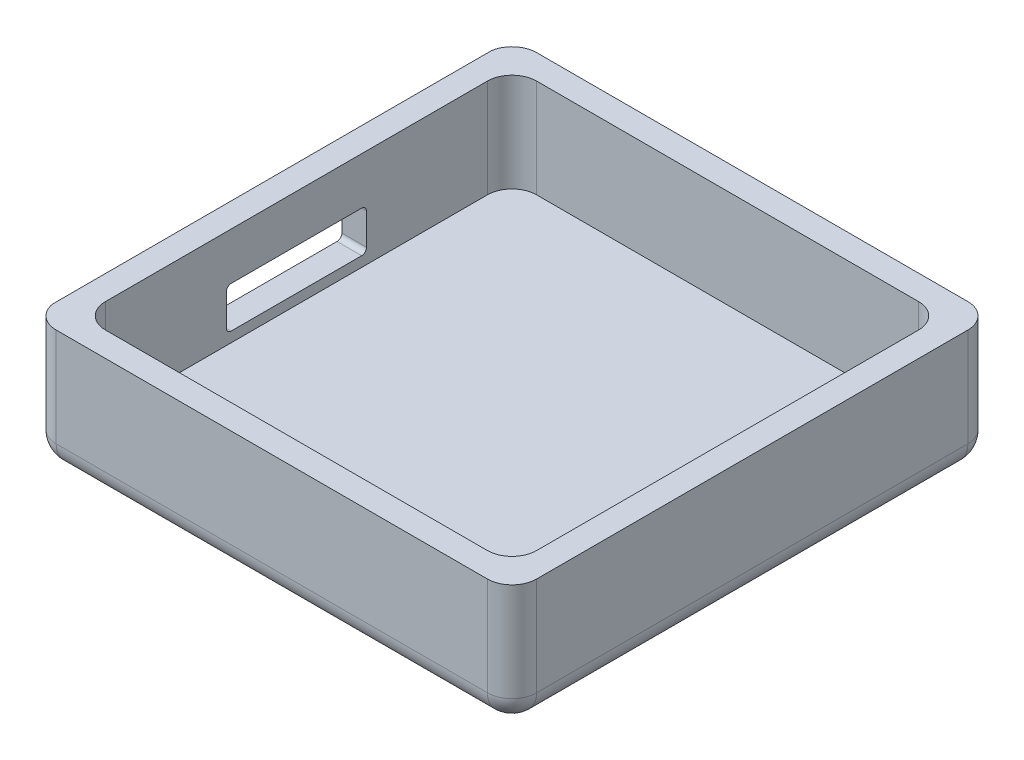
ISO-10303-21;
HEADER;
FILE_DESCRIPTION(('STEP AP214'),'2;1');
FILE_NAME('part.step','',(''),(''),'','','');
FILE_SCHEMA(('AUTOMOTIVE_DESIGN { 1 0 10303 214 1 1 1 1 }'));
ENDSEC;
DATA;
#1=APPLICATION_CONTEXT('core data for automotive mechanical design processes');
#2=APPLICATION_PROTOCOL_DEFINITION('international standard','automotive_design',2000,#1);
#3=PRODUCT_CONTEXT('',#1,'mechanical');
#4=PRODUCT('Part','Part','',(#3));
#5=PRODUCT_RELATED_PRODUCT_CATEGORY('part','',(#4));
#6=PRODUCT_DEFINITION_FORMATION('','',#4);
#7=PRODUCT_DEFINITION_CONTEXT('part definition',#1,'design');
#8=PRODUCT_DEFINITION('design','',#6,#7);
#9=PRODUCT_DEFINITION_SHAPE('','',#8);
#10=(LENGTH_UNIT() NAMED_UNIT(*) SI_UNIT(.MILLI.,.METRE.));
#11=(NAMED_UNIT(*) PLANE_ANGLE_UNIT() SI_UNIT($,.RADIAN.));
#12=(NAMED_UNIT(*) SI_UNIT($,.STERADIAN.) SOLID_ANGLE_UNIT());
#13=UNCERTAINTY_MEASURE_WITH_UNIT(LENGTH_MEASURE(1.E-05),#10,'distance_accuracy_value','');
#14=(GEOMETRIC_REPRESENTATION_CONTEXT(3) GLOBAL_UNCERTAINTY_ASSIGNED_CONTEXT((#13)) GLOBAL_UNIT_ASSIGNED_CONTEXT((#10,
#11,#12)) REPRESENTATION_CONTEXT('',''));
#15=CARTESIAN_POINT('',(0.,0.,0.));
#16=DIRECTION('',(0.,0.,1.));
#17=DIRECTION('',(1.,0.,0.));
#18=AXIS2_PLACEMENT_3D('',#15,#16,#17);
#19=CARTESIAN_POINT('',(-5.08,-12.7,0.));
#20=DIRECTION('',(1.,0.,0.));
#21=DIRECTION('',(0.,0.,-1.));
#22=AXIS2_PLACEMENT_3D('',#19,#20,#21);
#23=PLANE('',#22);
#24=DIRECTION('',(0.,0.,-1.));
#25=VECTOR('',#24,1.);
#26=CARTESIAN_POINT('',(-5.08,-12.7,0.));
#27=LINE('',#26,#25);
#28=CARTESIAN_POINT('',(-5.08,-12.7,-88.9));
#29=VERTEX_POINT('',#28);
#30=CARTESIAN_POINT('',(-5.08,-12.7,0.));
#31=VERTEX_POINT('',#30);
#32=EDGE_CURVE('E286',#29,#31,#27,.F.);
#33=ORIENTED_EDGE('',*,*,#32,.T.);
#34=DIRECTION('',(0.,1.,0.));
#35=VECTOR('',#34,1.);
#36=CARTESIAN_POINT('',(-5.08,-12.7,0.));
#37=LINE('',#36,#35);
#38=CARTESIAN_POINT('',(-5.08,0.,0.));
#39=VERTEX_POINT('',#38);
#40=EDGE_CURVE('E288',#31,#39,#37,.T.);
#41=ORIENTED_EDGE('',*,*,#40,.T.);
#42=DIRECTION('',(0.,0.,-1.));
#43=VECTOR('',#42,1.);
#44=CARTESIAN_POINT('',(-5.08,0.,0.));
#45=LINE('',#44,#43);
#46=CARTESIAN_POINT('',(-5.08,0.,-88.9));
#47=VERTEX_POINT('',#46);
#48=EDGE_CURVE('E265',#39,#47,#45,.T.);
#49=ORIENTED_EDGE('',*,*,#48,.T.);
#50=DIRECTION('',(0.,1.,0.));
#51=VECTOR('',#50,1.);
#52=CARTESIAN_POINT('',(-5.08,-12.7,-88.9));
#53=LINE('',#52,#51);
#54=EDGE_CURVE('E284',#47,#29,#53,.F.);
#55=ORIENTED_EDGE('',*,*,#54,.T.);
#56=EDGE_LOOP('',(#33,#41,#49,#55));
#57=FACE_BOUND('',#56,.T.);
#58=DIRECTION('',(0.,0.,1.));
#59=VECTOR('',#58,1.);
#60=CARTESIAN_POINT('',(-5.08,-2.1,0.));
#61=LINE('',#60,#59);
#62=CARTESIAN_POINT('',(-5.08,-2.1,-57.9));
#63=VERTEX_POINT('',#62);
#64=CARTESIAN_POINT('',(-5.08,-2.1,-31.));
#65=VERTEX_POINT('',#64);
#66=EDGE_CURVE('E425',#63,#65,#61,.T.);
#67=ORIENTED_EDGE('',*,*,#66,.T.);
#68=CARTESIAN_POINT('',(-5.08,-3.1,-31.));
#69=DIRECTION('',(1.,0.,0.));
#70=DIRECTION('',(0.,0.,-1.));
#71=AXIS2_PLACEMENT_3D('',#68,#69,#70);
#72=CIRCLE('',#71,1.);
#73=CARTESIAN_POINT('',(-5.08,-3.1,-30.));
#74=VERTEX_POINT('',#73);
#75=EDGE_CURVE('E400',#65,#74,#72,.T.);
#76=ORIENTED_EDGE('',*,*,#75,.T.);
#77=DIRECTION('',(0.,-1.,0.));
#78=VECTOR('',#77,1.);
#79=CARTESIAN_POINT('',(-5.08,0.,-30.));
#80=LINE('',#79,#78);
#81=CARTESIAN_POINT('',(-5.08,-9.6,-30.));
#82=VERTEX_POINT('',#81);
#83=EDGE_CURVE('E431',#74,#82,#80,.T.);
#84=ORIENTED_EDGE('',*,*,#83,.T.);
#85=CARTESIAN_POINT('',(-5.08,-9.6,-31.));
#86=DIRECTION('',(1.,0.,0.));
#87=DIRECTION('',(0.,0.,-1.));
#88=AXIS2_PLACEMENT_3D('',#85,#86,#87);
#89=CIRCLE('',#88,1.);
#90=CARTESIAN_POINT('',(-5.08,-10.6,-31.));
#91=VERTEX_POINT('',#90);
#92=EDGE_CURVE('E408',#82,#91,#89,.T.);
#93=ORIENTED_EDGE('',*,*,#92,.T.);
#94=DIRECTION('',(0.,0.,1.));
#95=VECTOR('',#94,1.);
#96=CARTESIAN_POINT('',(-5.08,-10.6,0.));
#97=LINE('',#96,#95);
#98=CARTESIAN_POINT('',(-5.08,-10.6,-57.9));
#99=VERTEX_POINT('',#98);
#100=EDGE_CURVE('E417',#99,#91,#97,.T.);
#101=ORIENTED_EDGE('',*,*,#100,.F.);
#102=CARTESIAN_POINT('',(-5.08,-9.6,-57.9));
#103=DIRECTION('',(1.,0.,0.));
#104=DIRECTION('',(0.,0.,-1.));
#105=AXIS2_PLACEMENT_3D('',#102,#103,#104);
#106=CIRCLE('',#105,1.);
#107=CARTESIAN_POINT('',(-5.08,-9.6,-58.9));
#108=VERTEX_POINT('',#107);
#109=EDGE_CURVE('E50',#99,#108,#106,.T.);
#110=ORIENTED_EDGE('',*,*,#109,.T.);
#111=DIRECTION('',(0.,-1.,0.));
#112=VECTOR('',#111,1.);
#113=CARTESIAN_POINT('',(-5.08,0.,-58.9));
#114=LINE('',#113,#112);
#115=CARTESIAN_POINT('',(-5.08,-3.1,-58.9));
#116=VERTEX_POINT('',#115);
#117=EDGE_CURVE('E416',#116,#108,#114,.T.);
#118=ORIENTED_EDGE('',*,*,#117,.F.);
#119=CARTESIAN_POINT('',(-5.08,-3.1,-57.9));
#120=DIRECTION('',(1.,0.,0.));
#121=DIRECTION('',(0.,0.,-1.));
#122=AXIS2_PLACEMENT_3D('',#119,#120,#121);
#123=CIRCLE('',#122,1.);
#124=EDGE_CURVE('E404',#116,#63,#123,.T.);
#125=ORIENTED_EDGE('',*,*,#124,.T.);
#126=EDGE_LOOP('',(#67,#76,#84,#93,#101,#110,#118,#125));
#127=FACE_BOUND('',#126,.T.);
#128=ADVANCED_FACE('F42',(#57,#127),#23,.F.);
#129=CARTESIAN_POINT('',(0.,-12.7,0.));
#130=DIRECTION('',(1.,0.,0.));
#131=DIRECTION('',(0.,0.,-1.));
#132=AXIS2_PLACEMENT_3D('',#129,#130,#131);
#133=PLANE('',#132);
#134=DIRECTION('',(0.,0.,-1.));
#135=VECTOR('',#134,1.);
#136=CARTESIAN_POINT('',(0.,-12.7,0.));
#137=LINE('',#136,#135);
#138=CARTESIAN_POINT('',(0.,-12.7,-5.08));
#139=VERTEX_POINT('',#138);
#140=CARTESIAN_POINT('',(0.,-12.7,-83.82));
#141=VERTEX_POINT('',#140);
#142=EDGE_CURVE('E264',#139,#141,#137,.T.);
#143=ORIENTED_EDGE('',*,*,#142,.T.);
#144=DIRECTION('',(0.,1.,0.));
#145=VECTOR('',#144,1.);
#146=CARTESIAN_POINT('',(0.,7.62,-83.82));
#147=LINE('',#146,#145);
#148=CARTESIAN_POINT('',(0.,7.62,-83.82));
#149=VERTEX_POINT('',#148);
#150=EDGE_CURVE('E363',#141,#149,#147,.T.);
#151=ORIENTED_EDGE('',*,*,#150,.T.);
#152=DIRECTION('',(0.,0.,-1.));
#153=VECTOR('',#152,1.);
#154=CARTESIAN_POINT('',(0.,7.62,0.));
#155=LINE('',#154,#153);
#156=CARTESIAN_POINT('',(0.,7.62,-5.08));
#157=VERTEX_POINT('',#156);
#158=EDGE_CURVE('E450',#157,#149,#155,.T.);
#159=ORIENTED_EDGE('',*,*,#158,.F.);
#160=DIRECTION('',(0.,1.,0.));
#161=VECTOR('',#160,1.);
#162=CARTESIAN_POINT('',(0.,-12.7,-5.08));
#163=LINE('',#162,#161);
#164=EDGE_CURVE('E366',#157,#139,#163,.F.);
#165=ORIENTED_EDGE('',*,*,#164,.T.);
#166=EDGE_LOOP('',(#143,#151,#159,#165));
#167=FACE_BOUND('',#166,.T.);
#168=DIRECTION('',(0.,-1.,0.));
#169=VECTOR('',#168,1.);
#170=CARTESIAN_POINT('',(0.,0.,-58.9));
#171=LINE('',#170,#169);
#172=CARTESIAN_POINT('',(0.,-3.1,-58.9));
#173=VERTEX_POINT('',#172);
#174=CARTESIAN_POINT('',(0.,-9.6,-58.9));
#175=VERTEX_POINT('',#174);
#176=EDGE_CURVE('E430',#173,#175,#171,.T.);
#177=ORIENTED_EDGE('',*,*,#176,.T.);
#178=CARTESIAN_POINT('',(0.,-9.6,-57.9));
#179=DIRECTION('',(1.,0.,0.));
#180=DIRECTION('',(0.,0.,-1.));
#181=AXIS2_PLACEMENT_3D('',#178,#179,#180);
#182=CIRCLE('',#181,1.);
#183=CARTESIAN_POINT('',(0.,-10.6,-57.9));
#184=VERTEX_POINT('',#183);
#185=EDGE_CURVE('E11',#175,#184,#182,.F.);
#186=ORIENTED_EDGE('',*,*,#185,.T.);
#187=DIRECTION('',(0.,0.,1.));
#188=VECTOR('',#187,1.);
#189=CARTESIAN_POINT('',(0.,-10.6,0.));
#190=LINE('',#189,#188);
#191=CARTESIAN_POINT('',(0.,-10.6,-31.));
#192=VERTEX_POINT('',#191);
#193=EDGE_CURVE('E428',#184,#192,#190,.T.);
#194=ORIENTED_EDGE('',*,*,#193,.T.);
#195=CARTESIAN_POINT('',(0.,-9.6,-31.));
#196=DIRECTION('',(1.,0.,0.));
#197=DIRECTION('',(0.,0.,-1.));
#198=AXIS2_PLACEMENT_3D('',#195,#196,#197);
#199=CIRCLE('',#198,1.);
#200=CARTESIAN_POINT('',(0.,-9.6,-30.));
#201=VERTEX_POINT('',#200);
#202=EDGE_CURVE('E410',#192,#201,#199,.F.);
#203=ORIENTED_EDGE('',*,*,#202,.T.);
#204=DIRECTION('',(0.,-1.,0.));
#205=VECTOR('',#204,1.);
#206=CARTESIAN_POINT('',(0.,0.,-30.));
#207=LINE('',#206,#205);
#208=CARTESIAN_POINT('',(0.,-3.1,-30.));
#209=VERTEX_POINT('',#208);
#210=EDGE_CURVE('E437',#209,#201,#207,.T.);
#211=ORIENTED_EDGE('',*,*,#210,.F.);
#212=CARTESIAN_POINT('',(0.,-3.1,-31.));
#213=DIRECTION('',(1.,0.,0.));
#214=DIRECTION('',(0.,0.,-1.));
#215=AXIS2_PLACEMENT_3D('',#212,#213,#214);
#216=CIRCLE('',#215,1.);
#217=CARTESIAN_POINT('',(0.,-2.1,-31.));
#218=VERTEX_POINT('',#217);
#219=EDGE_CURVE('E402',#209,#218,#216,.F.);
#220=ORIENTED_EDGE('',*,*,#219,.T.);
#221=DIRECTION('',(0.,0.,1.));
#222=VECTOR('',#221,1.);
#223=CARTESIAN_POINT('',(0.,-2.1,0.));
#224=LINE('',#223,#222);
#225=CARTESIAN_POINT('',(0.,-2.1,-57.9));
#226=VERTEX_POINT('',#225);
#227=EDGE_CURVE('E441',#226,#218,#224,.T.);
#228=ORIENTED_EDGE('',*,*,#227,.F.);
#229=CARTESIAN_POINT('',(0.,-3.1,-57.9));
#230=DIRECTION('',(1.,0.,0.));
#231=DIRECTION('',(0.,0.,-1.));
#232=AXIS2_PLACEMENT_3D('',#229,#230,#231);
#233=CIRCLE('',#232,1.);
#234=EDGE_CURVE('E406',#226,#173,#233,.F.);
#235=ORIENTED_EDGE('',*,*,#234,.T.);
#236=EDGE_LOOP('',(#177,#186,#194,#203,#211,#220,#228,#235));
#237=FACE_BOUND('',#236,.T.);
#238=ADVANCED_FACE('F536',(#167,#237),#133,.T.);
#239=CARTESIAN_POINT('',(0.,-12.7,0.));
#240=DIRECTION('',(0.,0.,1.));
#241=DIRECTION('',(1.,0.,0.));
#242=AXIS2_PLACEMENT_3D('',#239,#240,#241);
#243=PLANE('',#242);
#244=DIRECTION('',(0.,1.,0.));
#245=VECTOR('',#244,1.);
#246=CARTESIAN_POINT('',(83.82,-12.7,0.));
#247=LINE('',#246,#245);
#248=CARTESIAN_POINT('',(83.82,7.62,0.));
#249=VERTEX_POINT('',#248);
#250=CARTESIAN_POINT('',(83.82,-12.7,0.));
#251=VERTEX_POINT('',#250);
#252=EDGE_CURVE('E351',#249,#251,#247,.F.);
#253=ORIENTED_EDGE('',*,*,#252,.T.);
#254=DIRECTION('',(1.,0.,0.));
#255=VECTOR('',#254,1.);
#256=CARTESIAN_POINT('',(0.,-12.7,0.));
#257=LINE('',#256,#255);
#258=CARTESIAN_POINT('',(5.08,-12.7,0.));
#259=VERTEX_POINT('',#258);
#260=EDGE_CURVE('E262',#259,#251,#257,.T.);
#261=ORIENTED_EDGE('',*,*,#260,.F.);
#262=DIRECTION('',(0.,1.,0.));
#263=VECTOR('',#262,1.);
#264=CARTESIAN_POINT('',(5.08,-12.7,0.));
#265=LINE('',#264,#263);
#266=CARTESIAN_POINT('',(5.08,7.62,0.));
#267=VERTEX_POINT('',#266);
#268=EDGE_CURVE('E348',#259,#267,#265,.T.);
#269=ORIENTED_EDGE('',*,*,#268,.T.);
#270=DIRECTION('',(-1.,0.,0.));
#271=VECTOR('',#270,1.);
#272=CARTESIAN_POINT('',(0.,7.62,0.));
#273=LINE('',#272,#271);
#274=EDGE_CURVE('E447',#249,#267,#273,.T.);
#275=ORIENTED_EDGE('',*,*,#274,.F.);
#276=EDGE_LOOP('',(#253,#261,#269,#275));
#277=FACE_BOUND('',#276,.T.);
#278=ADVANCED_FACE('F541',(#277),#243,.F.);
#279=CARTESIAN_POINT('',(88.9,-12.7,0.));
#280=DIRECTION('',(1.,0.,0.));
#281=DIRECTION('',(0.,0.,-1.));
#282=AXIS2_PLACEMENT_3D('',#279,#280,#281);
#283=PLANE('',#282);
#284=DIRECTION('',(0.,0.,-1.));
#285=VECTOR('',#284,1.);
#286=CARTESIAN_POINT('',(88.9,-12.7,0.));
#287=LINE('',#286,#285);
#288=CARTESIAN_POINT('',(88.9,-12.7,-5.08));
#289=VERTEX_POINT('',#288);
#290=CARTESIAN_POINT('',(88.9,-12.7,-83.82));
#291=VERTEX_POINT('',#290);
#292=EDGE_CURVE('E270',#289,#291,#287,.T.);
#293=ORIENTED_EDGE('',*,*,#292,.F.);
#294=DIRECTION('',(0.,1.,0.));
#295=VECTOR('',#294,1.);
#296=CARTESIAN_POINT('',(88.9,7.62,-5.08));
#297=LINE('',#296,#295);
#298=CARTESIAN_POINT('',(88.9,7.62,-5.08));
#299=VERTEX_POINT('',#298);
#300=EDGE_CURVE('E345',#289,#299,#297,.T.);
#301=ORIENTED_EDGE('',*,*,#300,.T.);
#302=DIRECTION('',(0.,0.,1.));
#303=VECTOR('',#302,1.);
#304=CARTESIAN_POINT('',(88.9,7.62,0.));
#305=LINE('',#304,#303);
#306=CARTESIAN_POINT('',(88.9,7.62,-83.82));
#307=VERTEX_POINT('',#306);
#308=EDGE_CURVE('E444',#307,#299,#305,.T.);
#309=ORIENTED_EDGE('',*,*,#308,.F.);
#310=DIRECTION('',(0.,1.,0.));
#311=VECTOR('',#310,1.);
#312=CARTESIAN_POINT('',(88.9,-12.7,-83.82));
#313=LINE('',#312,#311);
#314=EDGE_CURVE('E311',#307,#291,#313,.F.);
#315=ORIENTED_EDGE('',*,*,#314,.T.);
#316=EDGE_LOOP('',(#293,#301,#309,#315));
#317=FACE_BOUND('',#316,.T.);
#318=ADVANCED_FACE('F574',(#317),#283,.F.);
#319=CARTESIAN_POINT('',(0.,-12.7,-88.9));
#320=DIRECTION('',(0.,0.,1.));
#321=DIRECTION('',(1.,0.,0.));
#322=AXIS2_PLACEMENT_3D('',#319,#320,#321);
#323=PLANE('',#322);
#324=DIRECTION('',(1.,0.,0.));
#325=VECTOR('',#324,1.);
#326=CARTESIAN_POINT('',(0.,-12.7,-88.9));
#327=LINE('',#326,#325);
#328=CARTESIAN_POINT('',(5.08,-12.7,-88.9));
#329=VERTEX_POINT('',#328);
#330=CARTESIAN_POINT('',(83.82,-12.7,-88.9));
#331=VERTEX_POINT('',#330);
#332=EDGE_CURVE('E267',#329,#331,#327,.T.);
#333=ORIENTED_EDGE('',*,*,#332,.T.);
#334=DIRECTION('',(0.,1.,0.));
#335=VECTOR('',#334,1.);
#336=CARTESIAN_POINT('',(83.82,-12.7,-88.9));
#337=LINE('',#336,#335);
#338=CARTESIAN_POINT('',(83.82,7.62,-88.9));
#339=VERTEX_POINT('',#338);
#340=EDGE_CURVE('E370',#331,#339,#337,.T.);
#341=ORIENTED_EDGE('',*,*,#340,.T.);
#342=DIRECTION('',(1.,0.,0.));
#343=VECTOR('',#342,1.);
#344=CARTESIAN_POINT('',(0.,7.62,-88.9));
#345=LINE('',#344,#343);
#346=CARTESIAN_POINT('',(5.08,7.62,-88.9));
#347=VERTEX_POINT('',#346);
#348=EDGE_CURVE('E248',#347,#339,#345,.T.);
#349=ORIENTED_EDGE('',*,*,#348,.F.);
#350=DIRECTION('',(0.,1.,0.));
#351=VECTOR('',#350,1.);
#352=CARTESIAN_POINT('',(5.08,-12.7,-88.9));
#353=LINE('',#352,#351);
#354=EDGE_CURVE('E368',#347,#329,#353,.F.);
#355=ORIENTED_EDGE('',*,*,#354,.T.);
#356=EDGE_LOOP('',(#333,#341,#349,#355));
#357=FACE_BOUND('',#356,.T.);
#358=ADVANCED_FACE('F552',(#357),#323,.T.);
#359=CARTESIAN_POINT('',(0.,-12.7,5.08));
#360=DIRECTION('',(0.,0.,-1.));
#361=DIRECTION('',(-1.,0.,0.));
#362=AXIS2_PLACEMENT_3D('',#359,#360,#361);
#363=PLANE('',#362);
#364=DIRECTION('',(-1.,0.,0.));
#365=VECTOR('',#364,1.);
#366=CARTESIAN_POINT('',(0.,-12.7,5.08));
#367=LINE('',#366,#365);
#368=CARTESIAN_POINT('',(0.,-12.7,5.08));
#369=VERTEX_POINT('',#368);
#370=CARTESIAN_POINT('',(88.9,-12.7,5.07999999999997));
#371=VERTEX_POINT('',#370);
#372=EDGE_CURVE('E296',#369,#371,#367,.F.);
#373=ORIENTED_EDGE('',*,*,#372,.T.);
#374=DIRECTION('',(0.,1.,0.));
#375=VECTOR('',#374,1.);
#376=CARTESIAN_POINT('',(88.9,0.,5.07999999999997));
#377=LINE('',#376,#375);
#378=CARTESIAN_POINT('',(88.9,7.62,5.07999999999997));
#379=VERTEX_POINT('',#378);
#380=EDGE_CURVE('E294',#371,#379,#377,.T.);
#381=ORIENTED_EDGE('',*,*,#380,.T.);
#382=DIRECTION('',(1.,0.,0.));
#383=VECTOR('',#382,1.);
#384=CARTESIAN_POINT('',(0.,7.62,5.08));
#385=LINE('',#384,#383);
#386=CARTESIAN_POINT('',(0.,7.62,5.08));
#387=VERTEX_POINT('',#386);
#388=EDGE_CURVE('E456',#387,#379,#385,.T.);
#389=ORIENTED_EDGE('',*,*,#388,.F.);
#390=DIRECTION('',(0.,1.,0.));
#391=VECTOR('',#390,1.);
#392=CARTESIAN_POINT('',(0.,-12.7,5.08));
#393=LINE('',#392,#391);
#394=EDGE_CURVE('E298',#387,#369,#393,.F.);
#395=ORIENTED_EDGE('',*,*,#394,.T.);
#396=EDGE_LOOP('',(#373,#381,#389,#395));
#397=FACE_BOUND('',#396,.T.);
#398=ADVANCED_FACE('F478',(#397),#363,.F.);
#399=CARTESIAN_POINT('',(0.,-12.7,-93.98));
#400=DIRECTION('',(0.,0.,1.));
#401=DIRECTION('',(1.,0.,0.));
#402=AXIS2_PLACEMENT_3D('',#399,#400,#401);
#403=PLANE('',#402);
#404=DIRECTION('',(0.,1.,0.));
#405=VECTOR('',#404,1.);
#406=CARTESIAN_POINT('',(0.,-12.7,-93.98));
#407=LINE('',#406,#405);
#408=CARTESIAN_POINT('',(0.,-12.7,-93.98));
#409=VERTEX_POINT('',#408);
#410=CARTESIAN_POINT('',(0.,7.62,-93.98));
#411=VERTEX_POINT('',#410);
#412=EDGE_CURVE('E306',#409,#411,#407,.T.);
#413=ORIENTED_EDGE('',*,*,#412,.T.);
#414=DIRECTION('',(-1.,0.,0.));
#415=VECTOR('',#414,1.);
#416=CARTESIAN_POINT('',(0.,7.62,-93.98));
#417=LINE('',#416,#415);
#418=CARTESIAN_POINT('',(88.9,7.62,-93.98));
#419=VERTEX_POINT('',#418);
#420=EDGE_CURVE('E245',#419,#411,#417,.T.);
#421=ORIENTED_EDGE('',*,*,#420,.F.);
#422=DIRECTION('',(0.,1.,0.));
#423=VECTOR('',#422,1.);
#424=CARTESIAN_POINT('',(88.9,-17.78,-93.98));
#425=LINE('',#424,#423);
#426=CARTESIAN_POINT('',(88.9,-12.7,-93.98));
#427=VERTEX_POINT('',#426);
#428=EDGE_CURVE('E310',#419,#427,#425,.F.);
#429=ORIENTED_EDGE('',*,*,#428,.T.);
#430=DIRECTION('',(1.,0.,0.));
#431=VECTOR('',#430,1.);
#432=CARTESIAN_POINT('',(0.,-12.7,-93.98));
#433=LINE('',#432,#431);
#434=EDGE_CURVE('E308',#427,#409,#433,.F.);
#435=ORIENTED_EDGE('',*,*,#434,.T.);
#436=EDGE_LOOP('',(#413,#421,#429,#435));
#437=FACE_BOUND('',#436,.T.);
#438=ADVANCED_FACE('F512',(#437),#403,.F.);
#439=CARTESIAN_POINT('',(93.98,-12.7,0.));
#440=DIRECTION('',(1.,0.,0.));
#441=DIRECTION('',(0.,0.,-1.));
#442=AXIS2_PLACEMENT_3D('',#439,#440,#441);
#443=PLANE('',#442);
#444=DIRECTION('',(0.,1.,0.));
#445=VECTOR('',#444,1.);
#446=CARTESIAN_POINT('',(93.98,0.,-88.9));
#447=LINE('',#446,#445);
#448=CARTESIAN_POINT('',(93.98,-12.7,-88.9));
#449=VERTEX_POINT('',#448);
#450=CARTESIAN_POINT('',(93.98,7.62,-88.9));
#451=VERTEX_POINT('',#450);
#452=EDGE_CURVE('E300',#449,#451,#447,.T.);
#453=ORIENTED_EDGE('',*,*,#452,.T.);
#454=DIRECTION('',(0.,0.,-1.));
#455=VECTOR('',#454,1.);
#456=CARTESIAN_POINT('',(93.98,7.62,0.));
#457=LINE('',#456,#455);
#458=CARTESIAN_POINT('',(93.98,7.62,0.));
#459=VERTEX_POINT('',#458);
#460=EDGE_CURVE('E462',#459,#451,#457,.T.);
#461=ORIENTED_EDGE('',*,*,#460,.F.);
#462=DIRECTION('',(0.,1.,0.));
#463=VECTOR('',#462,1.);
#464=CARTESIAN_POINT('',(93.98,-17.78,0.));
#465=LINE('',#464,#463);
#466=CARTESIAN_POINT('',(93.98,-12.7,0.));
#467=VERTEX_POINT('',#466);
#468=EDGE_CURVE('E304',#459,#467,#465,.F.);
#469=ORIENTED_EDGE('',*,*,#468,.T.);
#470=DIRECTION('',(0.,0.,1.));
#471=VECTOR('',#470,1.);
#472=CARTESIAN_POINT('',(93.98,-12.7,-93.98));
#473=LINE('',#472,#471);
#474=EDGE_CURVE('E302',#467,#449,#473,.F.);
#475=ORIENTED_EDGE('',*,*,#474,.T.);
#476=EDGE_LOOP('',(#453,#461,#469,#475));
#477=FACE_BOUND('',#476,.T.);
#478=ADVANCED_FACE('F504',(#477),#443,.T.);
#479=CARTESIAN_POINT('',(0.,0.,0.));
#480=DIRECTION('',(0.,1.,0.));
#481=DIRECTION('',(0.,0.,1.));
#482=AXIS2_PLACEMENT_3D('',#479,#480,#481);
#483=PLANE('',#482);
#484=CARTESIAN_POINT('',(0.,0.,-88.9));
#485=DIRECTION('',(0.,1.,0.));
#486=DIRECTION('',(0.,0.,1.));
#487=AXIS2_PLACEMENT_3D('',#484,#485,#486);
#488=CIRCLE('',#487,5.08);
#489=CARTESIAN_POINT('',(-5.01518473673634,0.,-89.7089017594287));
#490=VERTEX_POINT('',#489);
#491=EDGE_CURVE('E254',#490,#47,#488,.T.);
#492=ORIENTED_EDGE('',*,*,#491,.T.);
#493=ORIENTED_EDGE('',*,*,#48,.F.);
#494=CARTESIAN_POINT('',(0.,0.,0.));
#495=DIRECTION('',(0.,1.,0.));
#496=DIRECTION('',(0.,0.,1.));
#497=AXIS2_PLACEMENT_3D('',#494,#495,#496);
#498=CIRCLE('',#497,5.08);
#499=CARTESIAN_POINT('',(-5.01518473673634,0.,0.808901759428709));
#500=VERTEX_POINT('',#499);
#501=EDGE_CURVE('E291',#39,#500,#498,.T.);
#502=ORIENTED_EDGE('',*,*,#501,.T.);
#503=DIRECTION('',(0.,0.,1.));
#504=VECTOR('',#503,1.);
#505=CARTESIAN_POINT('',(-5.01518473673634,0.,0.));
#506=LINE('',#505,#504);
#507=EDGE_CURVE('E440',#490,#500,#506,.T.);
#508=ORIENTED_EDGE('',*,*,#507,.F.);
#509=EDGE_LOOP('',(#492,#493,#502,#508));
#510=FACE_BOUND('',#509,.T.);
#511=ADVANCED_FACE('F470',(#510),#483,.T.);
#512=CARTESIAN_POINT('',(0.,-12.7,0.));
#513=DIRECTION('',(0.,1.,0.));
#514=DIRECTION('',(0.,0.,1.));
#515=AXIS2_PLACEMENT_3D('',#512,#513,#514);
#516=PLANE('',#515);
#517=ORIENTED_EDGE('',*,*,#260,.T.);
#518=CARTESIAN_POINT('',(83.82,-12.7,-5.08));
#519=DIRECTION('',(0.,1.,0.));
#520=DIRECTION('',(0.,0.,1.));
#521=AXIS2_PLACEMENT_3D('',#518,#519,#520);
#522=CIRCLE('',#521,5.08);
#523=EDGE_CURVE('E361',#251,#289,#522,.T.);
#524=ORIENTED_EDGE('',*,*,#523,.T.);
#525=ORIENTED_EDGE('',*,*,#292,.T.);
#526=CARTESIAN_POINT('',(83.82,-12.7,-83.82));
#527=DIRECTION('',(0.,1.,0.));
#528=DIRECTION('',(0.,0.,1.));
#529=AXIS2_PLACEMENT_3D('',#526,#527,#528);
#530=CIRCLE('',#529,5.08);
#531=EDGE_CURVE('E357',#291,#331,#530,.T.);
#532=ORIENTED_EDGE('',*,*,#531,.T.);
#533=ORIENTED_EDGE('',*,*,#332,.F.);
#534=CARTESIAN_POINT('',(5.08,-12.7,-83.82));
#535=DIRECTION('',(0.,1.,0.));
#536=DIRECTION('',(0.,0.,1.));
#537=AXIS2_PLACEMENT_3D('',#534,#535,#536);
#538=CIRCLE('',#537,5.08);
#539=EDGE_CURVE('E354',#329,#141,#538,.T.);
#540=ORIENTED_EDGE('',*,*,#539,.T.);
#541=ORIENTED_EDGE('',*,*,#142,.F.);
#542=CARTESIAN_POINT('',(5.08,-12.7,-5.08));
#543=DIRECTION('',(0.,1.,0.));
#544=DIRECTION('',(0.,0.,1.));
#545=AXIS2_PLACEMENT_3D('',#542,#543,#544);
#546=CIRCLE('',#545,5.08);
#547=EDGE_CURVE('E359',#139,#259,#546,.T.);
#548=ORIENTED_EDGE('',*,*,#547,.T.);
#549=EDGE_LOOP('',(#517,#524,#525,#532,#533,#540,#541,#548));
#550=FACE_BOUND('',#549,.T.);
#551=ADVANCED_FACE('F568',(#550),#516,.T.);
#552=CARTESIAN_POINT('',(0.,-17.78,0.));
#553=DIRECTION('',(0.,1.,0.));
#554=DIRECTION('',(0.,0.,1.));
#555=AXIS2_PLACEMENT_3D('',#552,#553,#554);
#556=PLANE('',#555);
#557=DIRECTION('',(-1.,0.,0.));
#558=VECTOR('',#557,1.);
#559=CARTESIAN_POINT('',(0.,-17.78,0.));
#560=LINE('',#559,#558);
#561=CARTESIAN_POINT('',(88.9,-17.78,0.));
#562=VERTEX_POINT('',#561);
#563=CARTESIAN_POINT('',(0.,-17.78,0.));
#564=VERTEX_POINT('',#563);
#565=EDGE_CURVE('E279',#562,#564,#560,.T.);
#566=ORIENTED_EDGE('',*,*,#565,.T.);
#567=DIRECTION('',(0.,0.,-1.));
#568=VECTOR('',#567,1.);
#569=CARTESIAN_POINT('',(0.,-17.78,0.));
#570=LINE('',#569,#568);
#571=CARTESIAN_POINT('',(0.,-17.78,-88.9));
#572=VERTEX_POINT('',#571);
#573=EDGE_CURVE('E281',#564,#572,#570,.T.);
#574=ORIENTED_EDGE('',*,*,#573,.T.);
#575=DIRECTION('',(1.,0.,0.));
#576=VECTOR('',#575,1.);
#577=CARTESIAN_POINT('',(0.,-17.78,-88.9));
#578=LINE('',#577,#576);
#579=CARTESIAN_POINT('',(88.9,-17.78,-88.9));
#580=VERTEX_POINT('',#579);
#581=EDGE_CURVE('E273',#572,#580,#578,.T.);
#582=ORIENTED_EDGE('',*,*,#581,.T.);
#583=DIRECTION('',(0.,0.,1.));
#584=VECTOR('',#583,1.);
#585=CARTESIAN_POINT('',(88.9,-17.78,5.08));
#586=LINE('',#585,#584);
#587=EDGE_CURVE('E277',#580,#562,#586,.T.);
#588=ORIENTED_EDGE('',*,*,#587,.T.);
#589=EDGE_LOOP('',(#566,#574,#582,#588));
#590=FACE_BOUND('',#589,.T.);
#591=ADVANCED_FACE('F494',(#590),#556,.F.);
#592=CARTESIAN_POINT('',(88.9,-12.7,0.));
#593=DIRECTION('',(0.,-1.,0.));
#594=DIRECTION('',(0.,0.,-1.));
#595=AXIS2_PLACEMENT_3D('',#592,#593,#594);
#596=CYLINDRICAL_SURFACE('',#595,5.08);
#597=ORIENTED_EDGE('',*,*,#468,.F.);
#598=CARTESIAN_POINT('',(88.9,7.62,0.));
#599=DIRECTION('',(0.,1.,0.));
#600=DIRECTION('',(0.,0.,1.));
#601=AXIS2_PLACEMENT_3D('',#598,#599,#600);
#602=CIRCLE('',#601,5.08);
#603=EDGE_CURVE('E459',#379,#459,#602,.T.);
#604=ORIENTED_EDGE('',*,*,#603,.F.);
#605=ORIENTED_EDGE('',*,*,#380,.F.);
#606=CARTESIAN_POINT('',(88.9,-12.7,0.));
#607=DIRECTION('',(0.,-1.,0.));
#608=DIRECTION('',(0.,0.,-1.));
#609=AXIS2_PLACEMENT_3D('',#606,#607,#608);
#610=CIRCLE('',#609,5.08);
#611=EDGE_CURVE('E275',#467,#371,#610,.T.);
#612=ORIENTED_EDGE('',*,*,#611,.F.);
#613=EDGE_LOOP('',(#597,#604,#605,#612));
#614=FACE_BOUND('',#613,.T.);
#615=ADVANCED_FACE('F483',(#614),#596,.T.);
#616=CARTESIAN_POINT('',(88.9,-12.7,0.));
#617=DIRECTION('',(0.,0.,-1.));
#618=DIRECTION('',(-1.,0.,0.));
#619=AXIS2_PLACEMENT_3D('',#616,#617,#618);
#620=CYLINDRICAL_SURFACE('',#619,5.08);
#621=CARTESIAN_POINT('',(88.9,-12.7,-88.9));
#622=DIRECTION('',(0.,0.,-1.));
#623=DIRECTION('',(-1.,0.,0.));
#624=AXIS2_PLACEMENT_3D('',#621,#622,#623);
#625=CIRCLE('',#624,5.08);
#626=EDGE_CURVE('E336',#449,#580,#625,.T.);
#627=ORIENTED_EDGE('',*,*,#626,.F.);
#628=ORIENTED_EDGE('',*,*,#474,.F.);
#629=CARTESIAN_POINT('',(88.9,-12.7,0.));
#630=DIRECTION('',(0.,0.,1.));
#631=DIRECTION('',(1.,0.,0.));
#632=AXIS2_PLACEMENT_3D('',#629,#630,#631);
#633=CIRCLE('',#632,5.08);
#634=EDGE_CURVE('E339',#562,#467,#633,.T.);
#635=ORIENTED_EDGE('',*,*,#634,.F.);
#636=ORIENTED_EDGE('',*,*,#587,.F.);
#637=EDGE_LOOP('',(#627,#628,#635,#636));
#638=FACE_BOUND('',#637,.T.);
#639=ADVANCED_FACE('F501',(#638),#620,.T.);
#640=CARTESIAN_POINT('',(88.9,-12.7,-88.9));
#641=DIRECTION('',(0.,-1.,0.));
#642=DIRECTION('',(0.,0.,-1.));
#643=AXIS2_PLACEMENT_3D('',#640,#641,#642);
#644=CYLINDRICAL_SURFACE('',#643,5.08);
#645=ORIENTED_EDGE('',*,*,#428,.F.);
#646=CARTESIAN_POINT('',(88.9,7.62,-88.9));
#647=DIRECTION('',(0.,1.,0.));
#648=DIRECTION('',(0.,0.,1.));
#649=AXIS2_PLACEMENT_3D('',#646,#647,#648);
#650=CIRCLE('',#649,5.08);
#651=EDGE_CURVE('E465',#451,#419,#650,.T.);
#652=ORIENTED_EDGE('',*,*,#651,.F.);
#653=ORIENTED_EDGE('',*,*,#452,.F.);
#654=CARTESIAN_POINT('',(88.9,-12.7,-88.9));
#655=DIRECTION('',(0.,-1.,0.));
#656=DIRECTION('',(0.,0.,-1.));
#657=AXIS2_PLACEMENT_3D('',#654,#655,#656);
#658=CIRCLE('',#657,5.08);
#659=EDGE_CURVE('E333',#427,#449,#658,.T.);
#660=ORIENTED_EDGE('',*,*,#659,.F.);
#661=EDGE_LOOP('',(#645,#652,#653,#660));
#662=FACE_BOUND('',#661,.T.);
#663=ADVANCED_FACE('F509',(#662),#644,.T.);
#664=CARTESIAN_POINT('',(88.9,-12.7,0.));
#665=DIRECTION('',(0.,0.,1.));
#666=DIRECTION('',(1.,0.,0.));
#667=AXIS2_PLACEMENT_3D('',#664,#665,#666);
#668=SPHERICAL_SURFACE('',#667,5.08);
#669=ORIENTED_EDGE('',*,*,#634,.T.);
#670=ORIENTED_EDGE('',*,*,#611,.T.);
#671=CARTESIAN_POINT('',(88.9,-12.7,0.));
#672=DIRECTION('',(1.,0.,0.));
#673=DIRECTION('',(0.,0.,-1.));
#674=AXIS2_PLACEMENT_3D('',#671,#672,#673);
#675=CIRCLE('',#674,5.08);
#676=EDGE_CURVE('E330',#562,#371,#675,.F.);
#677=ORIENTED_EDGE('',*,*,#676,.F.);
#678=EDGE_LOOP('',(#669,#670,#677));
#679=FACE_BOUND('',#678,.T.);
#680=ADVANCED_FACE('F486',(#679),#668,.T.);
#681=CARTESIAN_POINT('',(88.9,-12.7,-88.9));
#682=DIRECTION('',(0.,0.,1.));
#683=DIRECTION('',(1.,0.,0.));
#684=AXIS2_PLACEMENT_3D('',#681,#682,#683);
#685=SPHERICAL_SURFACE('',#684,5.08);
#686=ORIENTED_EDGE('',*,*,#659,.T.);
#687=ORIENTED_EDGE('',*,*,#626,.T.);
#688=CARTESIAN_POINT('',(88.9,-12.7,-88.9));
#689=DIRECTION('',(1.,0.,0.));
#690=DIRECTION('',(0.,0.,-1.));
#691=AXIS2_PLACEMENT_3D('',#688,#689,#690);
#692=CIRCLE('',#691,5.08);
#693=EDGE_CURVE('E327',#427,#580,#692,.F.);
#694=ORIENTED_EDGE('',*,*,#693,.F.);
#695=EDGE_LOOP('',(#686,#687,#694));
#696=FACE_BOUND('',#695,.T.);
#697=ADVANCED_FACE('F808',(#696),#685,.T.);
#698=CARTESIAN_POINT('',(0.,-12.7,0.));
#699=DIRECTION('',(0.,1.,0.));
#700=DIRECTION('',(0.,0.,1.));
#701=AXIS2_PLACEMENT_3D('',#698,#699,#700);
#702=CYLINDRICAL_SURFACE('',#701,5.08);
#703=ORIENTED_EDGE('',*,*,#501,.F.);
#704=ORIENTED_EDGE('',*,*,#40,.F.);
#705=CARTESIAN_POINT('',(0.,-12.7,0.));
#706=DIRECTION('',(0.,-1.,0.));
#707=DIRECTION('',(0.,0.,-1.));
#708=AXIS2_PLACEMENT_3D('',#705,#706,#707);
#709=CIRCLE('',#708,5.08);
#710=EDGE_CURVE('E324',#369,#31,#709,.T.);
#711=ORIENTED_EDGE('',*,*,#710,.F.);
#712=ORIENTED_EDGE('',*,*,#394,.F.);
#713=CARTESIAN_POINT('',(0.,7.62,0.));
#714=DIRECTION('',(0.,1.,0.));
#715=DIRECTION('',(0.,0.,1.));
#716=AXIS2_PLACEMENT_3D('',#713,#714,#715);
#717=CIRCLE('',#716,5.08);
#718=CARTESIAN_POINT('',(-5.01518473673634,7.62,0.808901759428709));
#719=VERTEX_POINT('',#718);
#720=EDGE_CURVE('E237',#719,#387,#717,.T.);
#721=ORIENTED_EDGE('',*,*,#720,.F.);
#722=DIRECTION('',(0.,-1.,0.));
#723=VECTOR('',#722,1.);
#724=CARTESIAN_POINT('',(-5.01518473673634,7.62,0.808901759428709));
#725=LINE('',#724,#723);
#726=EDGE_CURVE('E233',#719,#500,#725,.T.);
#727=ORIENTED_EDGE('',*,*,#726,.T.);
#728=EDGE_LOOP('',(#703,#704,#711,#712,#721,#727));
#729=FACE_BOUND('',#728,.T.);
#730=ADVANCED_FACE('F473',(#729),#702,.T.);
#731=CARTESIAN_POINT('',(0.,-12.7,0.));
#732=DIRECTION('',(-1.,0.,0.));
#733=DIRECTION('',(0.,0.,1.));
#734=AXIS2_PLACEMENT_3D('',#731,#732,#733);
#735=CYLINDRICAL_SURFACE('',#734,5.08);
#736=ORIENTED_EDGE('',*,*,#676,.T.);
#737=ORIENTED_EDGE('',*,*,#372,.F.);
#738=CARTESIAN_POINT('',(0.,-12.7,0.));
#739=DIRECTION('',(-1.,0.,0.));
#740=DIRECTION('',(0.,0.,1.));
#741=AXIS2_PLACEMENT_3D('',#738,#739,#740);
#742=CIRCLE('',#741,5.08);
#743=EDGE_CURVE('E321',#564,#369,#742,.T.);
#744=ORIENTED_EDGE('',*,*,#743,.F.);
#745=ORIENTED_EDGE('',*,*,#565,.F.);
#746=EDGE_LOOP('',(#736,#737,#744,#745));
#747=FACE_BOUND('',#746,.T.);
#748=ADVANCED_FACE('F490',(#747),#735,.T.);
#749=CARTESIAN_POINT('',(0.,-12.7,-88.9));
#750=DIRECTION('',(1.,0.,0.));
#751=DIRECTION('',(0.,0.,-1.));
#752=AXIS2_PLACEMENT_3D('',#749,#750,#751);
#753=CYLINDRICAL_SURFACE('',#752,5.08);
#754=ORIENTED_EDGE('',*,*,#693,.T.);
#755=ORIENTED_EDGE('',*,*,#581,.F.);
#756=CARTESIAN_POINT('',(0.,-12.7,-88.9));
#757=DIRECTION('',(-1.,0.,0.));
#758=DIRECTION('',(0.,0.,1.));
#759=AXIS2_PLACEMENT_3D('',#756,#757,#758);
#760=CIRCLE('',#759,5.08);
#761=EDGE_CURVE('E318',#409,#572,#760,.T.);
#762=ORIENTED_EDGE('',*,*,#761,.F.);
#763=ORIENTED_EDGE('',*,*,#434,.F.);
#764=EDGE_LOOP('',(#754,#755,#762,#763));
#765=FACE_BOUND('',#764,.T.);
#766=ADVANCED_FACE('F518',(#765),#753,.T.);
#767=CARTESIAN_POINT('',(0.,-12.7,-88.9));
#768=DIRECTION('',(0.,1.,0.));
#769=DIRECTION('',(0.,0.,1.));
#770=AXIS2_PLACEMENT_3D('',#767,#768,#769);
#771=CYLINDRICAL_SURFACE('',#770,5.08);
#772=ORIENTED_EDGE('',*,*,#491,.F.);
#773=DIRECTION('',(0.,-1.,0.));
#774=VECTOR('',#773,1.);
#775=CARTESIAN_POINT('',(-5.01518473673634,7.62,-89.7089017594287));
#776=LINE('',#775,#774);
#777=CARTESIAN_POINT('',(-5.01518473673634,7.62,-89.7089017594287));
#778=VERTEX_POINT('',#777);
#779=EDGE_CURVE('E231',#778,#490,#776,.T.);
#780=ORIENTED_EDGE('',*,*,#779,.F.);
#781=CARTESIAN_POINT('',(0.,7.62,-88.9));
#782=DIRECTION('',(0.,1.,0.));
#783=DIRECTION('',(0.,0.,1.));
#784=AXIS2_PLACEMENT_3D('',#781,#782,#783);
#785=CIRCLE('',#784,5.08);
#786=EDGE_CURVE('E238',#411,#778,#785,.T.);
#787=ORIENTED_EDGE('',*,*,#786,.F.);
#788=ORIENTED_EDGE('',*,*,#412,.F.);
#789=CARTESIAN_POINT('',(0.,-12.7,-88.9));
#790=DIRECTION('',(0.,-1.,0.));
#791=DIRECTION('',(0.,0.,-1.));
#792=AXIS2_PLACEMENT_3D('',#789,#790,#791);
#793=CIRCLE('',#792,5.08);
#794=EDGE_CURVE('E315',#29,#409,#793,.T.);
#795=ORIENTED_EDGE('',*,*,#794,.F.);
#796=ORIENTED_EDGE('',*,*,#54,.F.);
#797=EDGE_LOOP('',(#772,#780,#787,#788,#795,#796));
#798=FACE_BOUND('',#797,.T.);
#799=ADVANCED_FACE('F251',(#798),#771,.T.);
#800=CARTESIAN_POINT('',(0.,-12.7,0.));
#801=DIRECTION('',(0.,0.,1.));
#802=DIRECTION('',(1.,0.,0.));
#803=AXIS2_PLACEMENT_3D('',#800,#801,#802);
#804=SPHERICAL_SURFACE('',#803,5.08);
#805=ORIENTED_EDGE('',*,*,#743,.T.);
#806=ORIENTED_EDGE('',*,*,#710,.T.);
#807=CARTESIAN_POINT('',(0.,-12.7,0.));
#808=DIRECTION('',(0.,0.,1.));
#809=DIRECTION('',(1.,0.,0.));
#810=AXIS2_PLACEMENT_3D('',#807,#808,#809);
#811=CIRCLE('',#810,5.08);
#812=EDGE_CURVE('E257',#564,#31,#811,.F.);
#813=ORIENTED_EDGE('',*,*,#812,.F.);
#814=EDGE_LOOP('',(#805,#806,#813));
#815=FACE_BOUND('',#814,.T.);
#816=ADVANCED_FACE('F526',(#815),#804,.T.);
#817=CARTESIAN_POINT('',(0.,-12.7,-88.9));
#818=DIRECTION('',(0.,0.,1.));
#819=DIRECTION('',(1.,0.,0.));
#820=AXIS2_PLACEMENT_3D('',#817,#818,#819);
#821=SPHERICAL_SURFACE('',#820,5.08);
#822=ORIENTED_EDGE('',*,*,#794,.T.);
#823=ORIENTED_EDGE('',*,*,#761,.T.);
#824=CARTESIAN_POINT('',(0.,-12.7,-88.9));
#825=DIRECTION('',(0.,0.,-1.));
#826=DIRECTION('',(-1.,0.,0.));
#827=AXIS2_PLACEMENT_3D('',#824,#825,#826);
#828=CIRCLE('',#827,5.08);
#829=EDGE_CURVE('E255',#29,#572,#828,.F.);
#830=ORIENTED_EDGE('',*,*,#829,.F.);
#831=EDGE_LOOP('',(#822,#823,#830));
#832=FACE_BOUND('',#831,.T.);
#833=ADVANCED_FACE('F521',(#832),#821,.T.);
#834=CARTESIAN_POINT('',(0.,-12.7,0.));
#835=DIRECTION('',(0.,0.,-1.));
#836=DIRECTION('',(-1.,0.,0.));
#837=AXIS2_PLACEMENT_3D('',#834,#835,#836);
#838=CYLINDRICAL_SURFACE('',#837,5.08);
#839=ORIENTED_EDGE('',*,*,#812,.T.);
#840=ORIENTED_EDGE('',*,*,#32,.F.);
#841=ORIENTED_EDGE('',*,*,#829,.T.);
#842=ORIENTED_EDGE('',*,*,#573,.F.);
#843=EDGE_LOOP('',(#839,#840,#841,#842));
#844=FACE_BOUND('',#843,.T.);
#845=ADVANCED_FACE('F523',(#844),#838,.T.);
#846=CARTESIAN_POINT('',(-5.01518473673634,7.62,0.));
#847=DIRECTION('',(1.,0.,0.));
#848=DIRECTION('',(0.,0.,-1.));
#849=AXIS2_PLACEMENT_3D('',#846,#847,#848);
#850=PLANE('',#849);
#851=ORIENTED_EDGE('',*,*,#507,.T.);
#852=ORIENTED_EDGE('',*,*,#726,.F.);
#853=DIRECTION('',(0.,0.,1.));
#854=VECTOR('',#853,1.);
#855=CARTESIAN_POINT('',(-5.01518473673634,7.62,0.));
#856=LINE('',#855,#854);
#857=EDGE_CURVE('E227',#778,#719,#856,.T.);
#858=ORIENTED_EDGE('',*,*,#857,.F.);
#859=ORIENTED_EDGE('',*,*,#779,.T.);
#860=EDGE_LOOP('',(#851,#852,#858,#859));
#861=FACE_BOUND('',#860,.T.);
#862=ADVANCED_FACE('F229',(#861),#850,.F.);
#863=CARTESIAN_POINT('',(0.,7.62,0.));
#864=DIRECTION('',(0.,1.,0.));
#865=DIRECTION('',(0.,0.,1.));
#866=AXIS2_PLACEMENT_3D('',#863,#864,#865);
#867=PLANE('',#866);
#868=ORIENTED_EDGE('',*,*,#348,.T.);
#869=CARTESIAN_POINT('',(83.82,7.62,-83.82));
#870=DIRECTION('',(0.,1.,0.));
#871=DIRECTION('',(0.,0.,1.));
#872=AXIS2_PLACEMENT_3D('',#869,#870,#871);
#873=CIRCLE('',#872,5.08);
#874=EDGE_CURVE('E377',#339,#307,#873,.F.);
#875=ORIENTED_EDGE('',*,*,#874,.T.);
#876=ORIENTED_EDGE('',*,*,#308,.T.);
#877=CARTESIAN_POINT('',(83.82,7.62,-5.08));
#878=DIRECTION('',(0.,1.,0.));
#879=DIRECTION('',(0.,0.,1.));
#880=AXIS2_PLACEMENT_3D('',#877,#878,#879);
#881=CIRCLE('',#880,5.08);
#882=EDGE_CURVE('E373',#299,#249,#881,.F.);
#883=ORIENTED_EDGE('',*,*,#882,.T.);
#884=ORIENTED_EDGE('',*,*,#274,.T.);
#885=CARTESIAN_POINT('',(5.08,7.62,-5.08));
#886=DIRECTION('',(0.,1.,0.));
#887=DIRECTION('',(0.,0.,1.));
#888=AXIS2_PLACEMENT_3D('',#885,#886,#887);
#889=CIRCLE('',#888,5.08);
#890=EDGE_CURVE('E375',#267,#157,#889,.F.);
#891=ORIENTED_EDGE('',*,*,#890,.T.);
#892=ORIENTED_EDGE('',*,*,#158,.T.);
#893=CARTESIAN_POINT('',(5.08,7.62,-83.82));
#894=DIRECTION('',(0.,1.,0.));
#895=DIRECTION('',(0.,0.,1.));
#896=AXIS2_PLACEMENT_3D('',#893,#894,#895);
#897=CIRCLE('',#896,5.08);
#898=EDGE_CURVE('E379',#149,#347,#897,.F.);
#899=ORIENTED_EDGE('',*,*,#898,.T.);
#900=EDGE_LOOP('',(#868,#875,#876,#883,#884,#891,#892,#899));
#901=FACE_BOUND('',#900,.T.);
#902=ORIENTED_EDGE('',*,*,#786,.T.);
#903=ORIENTED_EDGE('',*,*,#857,.T.);
#904=ORIENTED_EDGE('',*,*,#720,.T.);
#905=ORIENTED_EDGE('',*,*,#388,.T.);
#906=ORIENTED_EDGE('',*,*,#603,.T.);
#907=ORIENTED_EDGE('',*,*,#460,.T.);
#908=ORIENTED_EDGE('',*,*,#651,.T.);
#909=ORIENTED_EDGE('',*,*,#420,.T.);
#910=EDGE_LOOP('',(#902,#903,#904,#905,#906,#907,#908,#909));
#911=FACE_BOUND('',#910,.T.);
#912=ADVANCED_FACE('F242',(#901,#911),#867,.T.);
#913=CARTESIAN_POINT('',(83.82,-12.7,-5.08));
#914=DIRECTION('',(0.,-1.,0.));
#915=DIRECTION('',(0.,0.,-1.));
#916=AXIS2_PLACEMENT_3D('',#913,#914,#915);
#917=CYLINDRICAL_SURFACE('',#916,5.08);
#918=ORIENTED_EDGE('',*,*,#523,.F.);
#919=ORIENTED_EDGE('',*,*,#252,.F.);
#920=ORIENTED_EDGE('',*,*,#882,.F.);
#921=ORIENTED_EDGE('',*,*,#300,.F.);
#922=EDGE_LOOP('',(#918,#919,#920,#921));
#923=FACE_BOUND('',#922,.T.);
#924=ADVANCED_FACE('F561',(#923),#917,.F.);
#925=CARTESIAN_POINT('',(5.08,-12.7,-5.08));
#926=DIRECTION('',(0.,1.,0.));
#927=DIRECTION('',(0.,0.,1.));
#928=AXIS2_PLACEMENT_3D('',#925,#926,#927);
#929=CYLINDRICAL_SURFACE('',#928,5.08);
#930=ORIENTED_EDGE('',*,*,#547,.F.);
#931=ORIENTED_EDGE('',*,*,#164,.F.);
#932=ORIENTED_EDGE('',*,*,#890,.F.);
#933=ORIENTED_EDGE('',*,*,#268,.F.);
#934=EDGE_LOOP('',(#930,#931,#932,#933));
#935=FACE_BOUND('',#934,.T.);
#936=ADVANCED_FACE('F603',(#935),#929,.F.);
#937=CARTESIAN_POINT('',(83.82,-12.7,-83.82));
#938=DIRECTION('',(0.,1.,0.));
#939=DIRECTION('',(0.,0.,1.));
#940=AXIS2_PLACEMENT_3D('',#937,#938,#939);
#941=CYLINDRICAL_SURFACE('',#940,5.08);
#942=ORIENTED_EDGE('',*,*,#531,.F.);
#943=ORIENTED_EDGE('',*,*,#314,.F.);
#944=ORIENTED_EDGE('',*,*,#874,.F.);
#945=ORIENTED_EDGE('',*,*,#340,.F.);
#946=EDGE_LOOP('',(#942,#943,#944,#945));
#947=FACE_BOUND('',#946,.T.);
#948=ADVANCED_FACE('F589',(#947),#941,.F.);
#949=CARTESIAN_POINT('',(5.08,-12.7,-83.82));
#950=DIRECTION('',(0.,-1.,0.));
#951=DIRECTION('',(0.,0.,-1.));
#952=AXIS2_PLACEMENT_3D('',#949,#950,#951);
#953=CYLINDRICAL_SURFACE('',#952,5.08);
#954=ORIENTED_EDGE('',*,*,#539,.F.);
#955=ORIENTED_EDGE('',*,*,#354,.F.);
#956=ORIENTED_EDGE('',*,*,#898,.F.);
#957=ORIENTED_EDGE('',*,*,#150,.F.);
#958=EDGE_LOOP('',(#954,#955,#956,#957));
#959=FACE_BOUND('',#958,.T.);
#960=ADVANCED_FACE('F609',(#959),#953,.F.);
#961=CARTESIAN_POINT('',(30.1240767493379,0.,-30.));
#962=DIRECTION('',(0.,0.,-1.));
#963=DIRECTION('',(-1.,0.,0.));
#964=AXIS2_PLACEMENT_3D('',#961,#962,#963);
#965=PLANE('',#964);
#966=ORIENTED_EDGE('',*,*,#83,.F.);
#967=DIRECTION('',(-1.,0.,0.));
#968=VECTOR('',#967,1.);
#969=CARTESIAN_POINT('',(0.,-3.1,-30.));
#970=LINE('',#969,#968);
#971=EDGE_CURVE('E389',#74,#209,#970,.F.);
#972=ORIENTED_EDGE('',*,*,#971,.T.);
#973=ORIENTED_EDGE('',*,*,#210,.T.);
#974=DIRECTION('',(-1.,0.,0.));
#975=VECTOR('',#974,1.);
#976=CARTESIAN_POINT('',(30.1240767493379,-9.6,-30.));
#977=LINE('',#976,#975);
#978=EDGE_CURVE('E386',#201,#82,#977,.T.);
#979=ORIENTED_EDGE('',*,*,#978,.T.);
#980=EDGE_LOOP('',(#966,#972,#973,#979));
#981=FACE_BOUND('',#980,.T.);
#982=ADVANCED_FACE('F611',(#981),#965,.T.);
#983=CARTESIAN_POINT('',(30.1240767493379,-10.6,0.));
#984=DIRECTION('',(0.,-1.,0.));
#985=DIRECTION('',(0.,0.,-1.));
#986=AXIS2_PLACEMENT_3D('',#983,#984,#985);
#987=PLANE('',#986);
#988=ORIENTED_EDGE('',*,*,#100,.T.);
#989=DIRECTION('',(-1.,0.,0.));
#990=VECTOR('',#989,1.);
#991=CARTESIAN_POINT('',(30.1240767493379,-10.6,-31.));
#992=LINE('',#991,#990);
#993=EDGE_CURVE('E57',#91,#192,#992,.F.);
#994=ORIENTED_EDGE('',*,*,#993,.T.);
#995=ORIENTED_EDGE('',*,*,#193,.F.);
#996=DIRECTION('',(-1.,0.,0.));
#997=VECTOR('',#996,1.);
#998=CARTESIAN_POINT('',(-5.08,-10.6,-57.9));
#999=LINE('',#998,#997);
#1000=EDGE_CURVE('E396',#184,#99,#999,.T.);
#1001=ORIENTED_EDGE('',*,*,#1000,.T.);
#1002=EDGE_LOOP('',(#988,#994,#995,#1001));
#1003=FACE_BOUND('',#1002,.T.);
#1004=ADVANCED_FACE('F427',(#1003),#987,.F.);
#1005=CARTESIAN_POINT('',(30.1240767493379,0.,-58.9));
#1006=DIRECTION('',(0.,0.,-1.));
#1007=DIRECTION('',(-1.,0.,0.));
#1008=AXIS2_PLACEMENT_3D('',#1005,#1006,#1007);
#1009=PLANE('',#1008);
#1010=ORIENTED_EDGE('',*,*,#176,.F.);
#1011=DIRECTION('',(-1.,0.,0.));
#1012=VECTOR('',#1011,1.);
#1013=CARTESIAN_POINT('',(30.1240767493379,-3.1,-58.9));
#1014=LINE('',#1013,#1012);
#1015=EDGE_CURVE('E393',#173,#116,#1014,.T.);
#1016=ORIENTED_EDGE('',*,*,#1015,.T.);
#1017=ORIENTED_EDGE('',*,*,#117,.T.);
#1018=DIRECTION('',(-1.,0.,0.));
#1019=VECTOR('',#1018,1.);
#1020=CARTESIAN_POINT('',(0.,-9.6,-58.9));
#1021=LINE('',#1020,#1019);
#1022=EDGE_CURVE('E391',#108,#175,#1021,.F.);
#1023=ORIENTED_EDGE('',*,*,#1022,.T.);
#1024=EDGE_LOOP('',(#1010,#1016,#1017,#1023));
#1025=FACE_BOUND('',#1024,.T.);
#1026=ADVANCED_FACE('F423',(#1025),#1009,.F.);
#1027=CARTESIAN_POINT('',(30.1240767493379,-2.1,0.));
#1028=DIRECTION('',(0.,-1.,0.));
#1029=DIRECTION('',(0.,0.,-1.));
#1030=AXIS2_PLACEMENT_3D('',#1027,#1028,#1029);
#1031=PLANE('',#1030);
#1032=ORIENTED_EDGE('',*,*,#227,.T.);
#1033=DIRECTION('',(-1.,0.,0.));
#1034=VECTOR('',#1033,1.);
#1035=CARTESIAN_POINT('',(-5.08,-2.1,-31.));
#1036=LINE('',#1035,#1034);
#1037=EDGE_CURVE('E383',#218,#65,#1036,.T.);
#1038=ORIENTED_EDGE('',*,*,#1037,.T.);
#1039=ORIENTED_EDGE('',*,*,#66,.F.);
#1040=DIRECTION('',(-1.,0.,0.));
#1041=VECTOR('',#1040,1.);
#1042=CARTESIAN_POINT('',(30.1240767493379,-2.1,-57.9));
#1043=LINE('',#1042,#1041);
#1044=EDGE_CURVE('E381',#63,#226,#1043,.F.);
#1045=ORIENTED_EDGE('',*,*,#1044,.T.);
#1046=EDGE_LOOP('',(#1032,#1038,#1039,#1045));
#1047=FACE_BOUND('',#1046,.T.);
#1048=ADVANCED_FACE('F625',(#1047),#1031,.T.);
#1049=CARTESIAN_POINT('',(30.1240767493379,-3.1,-31.));
#1050=DIRECTION('',(1.,0.,0.));
#1051=DIRECTION('',(0.,0.,-1.));
#1052=AXIS2_PLACEMENT_3D('',#1049,#1050,#1051);
#1053=CYLINDRICAL_SURFACE('',#1052,1.);
#1054=ORIENTED_EDGE('',*,*,#219,.F.);
#1055=ORIENTED_EDGE('',*,*,#971,.F.);
#1056=ORIENTED_EDGE('',*,*,#75,.F.);
#1057=ORIENTED_EDGE('',*,*,#1037,.F.);
#1058=EDGE_LOOP('',(#1054,#1055,#1056,#1057));
#1059=FACE_BOUND('',#1058,.T.);
#1060=ADVANCED_FACE('F621',(#1059),#1053,.F.);
#1061=CARTESIAN_POINT('',(30.1240767493379,-3.1,-57.9));
#1062=DIRECTION('',(-1.,0.,0.));
#1063=DIRECTION('',(0.,0.,1.));
#1064=AXIS2_PLACEMENT_3D('',#1061,#1062,#1063);
#1065=CYLINDRICAL_SURFACE('',#1064,1.);
#1066=ORIENTED_EDGE('',*,*,#234,.F.);
#1067=ORIENTED_EDGE('',*,*,#1044,.F.);
#1068=ORIENTED_EDGE('',*,*,#124,.F.);
#1069=ORIENTED_EDGE('',*,*,#1015,.F.);
#1070=EDGE_LOOP('',(#1066,#1067,#1068,#1069));
#1071=FACE_BOUND('',#1070,.T.);
#1072=ADVANCED_FACE('F624',(#1071),#1065,.F.);
#1073=CARTESIAN_POINT('',(30.1240767493379,-9.6,-31.));
#1074=DIRECTION('',(-1.,0.,0.));
#1075=DIRECTION('',(0.,0.,1.));
#1076=AXIS2_PLACEMENT_3D('',#1073,#1074,#1075);
#1077=CYLINDRICAL_SURFACE('',#1076,1.);
#1078=ORIENTED_EDGE('',*,*,#202,.F.);
#1079=ORIENTED_EDGE('',*,*,#993,.F.);
#1080=ORIENTED_EDGE('',*,*,#92,.F.);
#1081=ORIENTED_EDGE('',*,*,#978,.F.);
#1082=EDGE_LOOP('',(#1078,#1079,#1080,#1081));
#1083=FACE_BOUND('',#1082,.T.);
#1084=ADVANCED_FACE('F628',(#1083),#1077,.F.);
#1085=CARTESIAN_POINT('',(30.1240767493379,-9.6,-57.9));
#1086=DIRECTION('',(1.,0.,0.));
#1087=DIRECTION('',(0.,0.,-1.));
#1088=AXIS2_PLACEMENT_3D('',#1085,#1086,#1087);
#1089=CYLINDRICAL_SURFACE('',#1088,1.);
#1090=ORIENTED_EDGE('',*,*,#185,.F.);
#1091=ORIENTED_EDGE('',*,*,#1022,.F.);
#1092=ORIENTED_EDGE('',*,*,#109,.F.);
#1093=ORIENTED_EDGE('',*,*,#1000,.F.);
#1094=EDGE_LOOP('',(#1090,#1091,#1092,#1093));
#1095=FACE_BOUND('',#1094,.T.);
#1096=ADVANCED_FACE('F44',(#1095),#1089,.F.);
#1097=CLOSED_SHELL('',(#128,#238,#278,#318,#358,#398,#438,#478,#511,#551,#591,#615,#639,#663,
#680,#697,#730,#748,#766,#799,#816,#833,#845,#862,#912,#924,#936,#948,#960,#982,#1004,#1026,
#1048,#1060,#1072,#1084,#1096));
#1098=MANIFOLD_SOLID_BREP('B2',#1097);
#1099=ADVANCED_BREP_SHAPE_REPRESENTATION('',(#18,#1098),#14);
#1100=SHAPE_DEFINITION_REPRESENTATION(#9,#1099);
ENDSEC;
END-ISO-10303-21;
